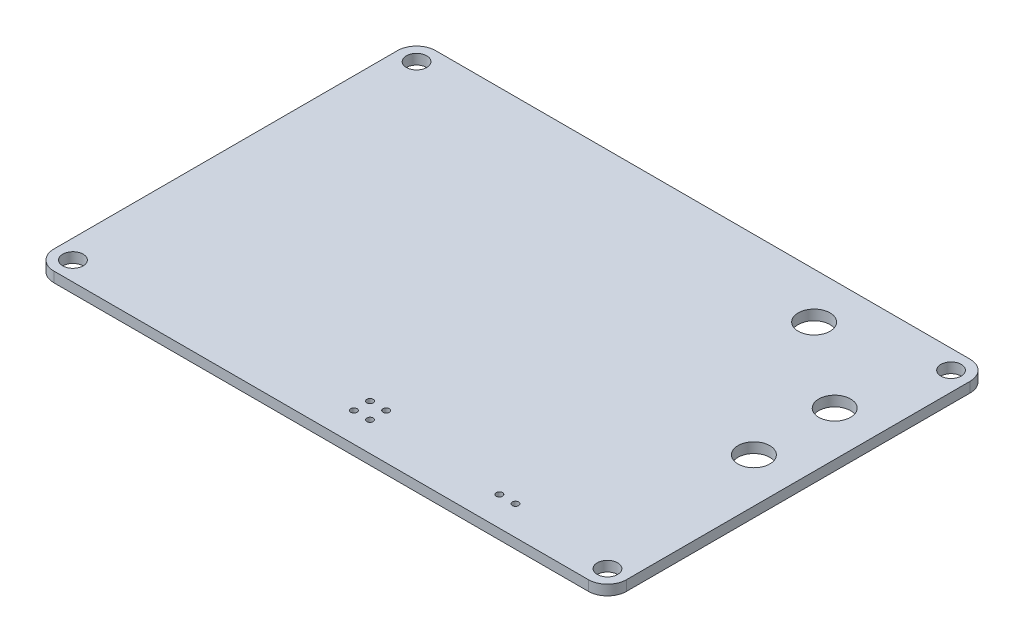
ISO-10303-21;
HEADER;
FILE_DESCRIPTION(('STEP AP214'),'2;1');
FILE_NAME('part.step','',(''),(''),'','','');
FILE_SCHEMA(('AUTOMOTIVE_DESIGN { 1 0 10303 214 1 1 1 1 }'));
ENDSEC;
DATA;
#1=APPLICATION_CONTEXT('core data for automotive mechanical design processes');
#2=APPLICATION_PROTOCOL_DEFINITION('international standard','automotive_design',2000,#1);
#3=PRODUCT_CONTEXT('',#1,'mechanical');
#4=PRODUCT('Part','Part','',(#3));
#5=PRODUCT_RELATED_PRODUCT_CATEGORY('part','',(#4));
#6=PRODUCT_DEFINITION_FORMATION('','',#4);
#7=PRODUCT_DEFINITION_CONTEXT('part definition',#1,'design');
#8=PRODUCT_DEFINITION('design','',#6,#7);
#9=PRODUCT_DEFINITION_SHAPE('','',#8);
#10=(LENGTH_UNIT() NAMED_UNIT(*) SI_UNIT(.MILLI.,.METRE.));
#11=(NAMED_UNIT(*) PLANE_ANGLE_UNIT() SI_UNIT($,.RADIAN.));
#12=(NAMED_UNIT(*) SI_UNIT($,.STERADIAN.) SOLID_ANGLE_UNIT());
#13=UNCERTAINTY_MEASURE_WITH_UNIT(LENGTH_MEASURE(1.E-05),#10,'distance_accuracy_value','');
#14=(GEOMETRIC_REPRESENTATION_CONTEXT(3) GLOBAL_UNCERTAINTY_ASSIGNED_CONTEXT((#13)) GLOBAL_UNIT_ASSIGNED_CONTEXT((#10,
#11,#12)) REPRESENTATION_CONTEXT('',''));
#15=CARTESIAN_POINT('',(0.,0.,0.));
#16=DIRECTION('',(0.,0.,1.));
#17=DIRECTION('',(1.,0.,0.));
#18=AXIS2_PLACEMENT_3D('',#15,#16,#17);
#19=CARTESIAN_POINT('',(-45.,1.6,30.));
#20=DIRECTION('',(1.,0.,0.));
#21=DIRECTION('',(0.,0.,-1.));
#22=AXIS2_PLACEMENT_3D('',#19,#20,#21);
#23=PLANE('',#22);
#24=DIRECTION('',(0.,0.,1.));
#25=VECTOR('',#24,1.);
#26=CARTESIAN_POINT('',(-45.,0.,30.));
#27=LINE('',#26,#25);
#28=CARTESIAN_POINT('',(-45.,0.,-27.));
#29=VERTEX_POINT('',#28);
#30=CARTESIAN_POINT('',(-45.,0.,27.));
#31=VERTEX_POINT('',#30);
#32=EDGE_CURVE('E157',#29,#31,#27,.T.);
#33=ORIENTED_EDGE('',*,*,#32,.T.);
#34=DIRECTION('',(0.,-1.,0.));
#35=VECTOR('',#34,1.);
#36=CARTESIAN_POINT('',(-45.,1.6,27.));
#37=LINE('',#36,#35);
#38=CARTESIAN_POINT('',(-45.,1.6,27.));
#39=VERTEX_POINT('',#38);
#40=EDGE_CURVE('E11',#31,#39,#37,.F.);
#41=ORIENTED_EDGE('',*,*,#40,.T.);
#42=DIRECTION('',(0.,0.,1.));
#43=VECTOR('',#42,1.);
#44=CARTESIAN_POINT('',(-45.,1.6,30.));
#45=LINE('',#44,#43);
#46=CARTESIAN_POINT('',(-45.,1.6,-27.));
#47=VERTEX_POINT('',#46);
#48=EDGE_CURVE('E125',#47,#39,#45,.T.);
#49=ORIENTED_EDGE('',*,*,#48,.F.);
#50=DIRECTION('',(0.,-1.,0.));
#51=VECTOR('',#50,1.);
#52=CARTESIAN_POINT('',(-45.,1.6,-27.));
#53=LINE('',#52,#51);
#54=EDGE_CURVE('E41',#47,#29,#53,.T.);
#55=ORIENTED_EDGE('',*,*,#54,.T.);
#56=EDGE_LOOP('',(#33,#41,#49,#55));
#57=FACE_BOUND('',#56,.T.);
#58=ADVANCED_FACE('F33',(#57),#23,.F.);
#59=CARTESIAN_POINT('',(45.,1.6,30.));
#60=DIRECTION('',(0.,0.,-1.));
#61=DIRECTION('',(-1.,0.,0.));
#62=AXIS2_PLACEMENT_3D('',#59,#60,#61);
#63=PLANE('',#62);
#64=DIRECTION('',(1.,0.,0.));
#65=VECTOR('',#64,1.);
#66=CARTESIAN_POINT('',(45.,0.,30.));
#67=LINE('',#66,#65);
#68=CARTESIAN_POINT('',(-42.,0.,30.));
#69=VERTEX_POINT('',#68);
#70=CARTESIAN_POINT('',(42.,0.,30.));
#71=VERTEX_POINT('',#70);
#72=EDGE_CURVE('E130',#69,#71,#67,.T.);
#73=ORIENTED_EDGE('',*,*,#72,.T.);
#74=DIRECTION('',(0.,-1.,0.));
#75=VECTOR('',#74,1.);
#76=CARTESIAN_POINT('',(42.,1.6,30.));
#77=LINE('',#76,#75);
#78=CARTESIAN_POINT('',(42.,1.6,30.));
#79=VERTEX_POINT('',#78);
#80=EDGE_CURVE('E48',#71,#79,#77,.F.);
#81=ORIENTED_EDGE('',*,*,#80,.T.);
#82=DIRECTION('',(1.,0.,0.));
#83=VECTOR('',#82,1.);
#84=CARTESIAN_POINT('',(45.,1.6,30.));
#85=LINE('',#84,#83);
#86=CARTESIAN_POINT('',(-42.,1.6,30.));
#87=VERTEX_POINT('',#86);
#88=EDGE_CURVE('E128',#87,#79,#85,.T.);
#89=ORIENTED_EDGE('',*,*,#88,.F.);
#90=DIRECTION('',(0.,-1.,0.));
#91=VECTOR('',#90,1.);
#92=CARTESIAN_POINT('',(-42.,1.6,30.));
#93=LINE('',#92,#91);
#94=EDGE_CURVE('E149',#87,#69,#93,.T.);
#95=ORIENTED_EDGE('',*,*,#94,.T.);
#96=EDGE_LOOP('',(#73,#81,#89,#95));
#97=FACE_BOUND('',#96,.T.);
#98=ADVANCED_FACE('F291',(#97),#63,.F.);
#99=CARTESIAN_POINT('',(45.,1.6,30.));
#100=DIRECTION('',(-1.,0.,0.));
#101=DIRECTION('',(0.,0.,1.));
#102=AXIS2_PLACEMENT_3D('',#99,#100,#101);
#103=PLANE('',#102);
#104=DIRECTION('',(0.,0.,-1.));
#105=VECTOR('',#104,1.);
#106=CARTESIAN_POINT('',(45.,0.,30.));
#107=LINE('',#106,#105);
#108=CARTESIAN_POINT('',(45.,0.,27.));
#109=VERTEX_POINT('',#108);
#110=CARTESIAN_POINT('',(45.,0.,-27.));
#111=VERTEX_POINT('',#110);
#112=EDGE_CURVE('E126',#109,#111,#107,.T.);
#113=ORIENTED_EDGE('',*,*,#112,.T.);
#114=DIRECTION('',(0.,-1.,0.));
#115=VECTOR('',#114,1.);
#116=CARTESIAN_POINT('',(45.,1.6,-27.));
#117=LINE('',#116,#115);
#118=CARTESIAN_POINT('',(45.,1.6,-27.));
#119=VERTEX_POINT('',#118);
#120=EDGE_CURVE('E104',#111,#119,#117,.F.);
#121=ORIENTED_EDGE('',*,*,#120,.T.);
#122=DIRECTION('',(0.,0.,-1.));
#123=VECTOR('',#122,1.);
#124=CARTESIAN_POINT('',(45.,1.6,30.));
#125=LINE('',#124,#123);
#126=CARTESIAN_POINT('',(45.,1.6,27.));
#127=VERTEX_POINT('',#126);
#128=EDGE_CURVE('E169',#127,#119,#125,.T.);
#129=ORIENTED_EDGE('',*,*,#128,.F.);
#130=DIRECTION('',(0.,-1.,0.));
#131=VECTOR('',#130,1.);
#132=CARTESIAN_POINT('',(45.,1.6,27.));
#133=LINE('',#132,#131);
#134=EDGE_CURVE('E109',#127,#109,#133,.T.);
#135=ORIENTED_EDGE('',*,*,#134,.T.);
#136=EDGE_LOOP('',(#113,#121,#129,#135));
#137=FACE_BOUND('',#136,.T.);
#138=ADVANCED_FACE('F288',(#137),#103,.F.);
#139=CARTESIAN_POINT('',(45.,1.6,-30.));
#140=DIRECTION('',(0.,0.,1.));
#141=DIRECTION('',(1.,0.,0.));
#142=AXIS2_PLACEMENT_3D('',#139,#140,#141);
#143=PLANE('',#142);
#144=DIRECTION('',(-1.,0.,0.));
#145=VECTOR('',#144,1.);
#146=CARTESIAN_POINT('',(45.,1.6,-30.));
#147=LINE('',#146,#145);
#148=CARTESIAN_POINT('',(42.,1.6,-30.));
#149=VERTEX_POINT('',#148);
#150=CARTESIAN_POINT('',(-42.,1.6,-30.));
#151=VERTEX_POINT('',#150);
#152=EDGE_CURVE('E119',#149,#151,#147,.T.);
#153=ORIENTED_EDGE('',*,*,#152,.F.);
#154=DIRECTION('',(0.,-1.,0.));
#155=VECTOR('',#154,1.);
#156=CARTESIAN_POINT('',(42.,1.6,-30.));
#157=LINE('',#156,#155);
#158=CARTESIAN_POINT('',(42.,0.,-30.));
#159=VERTEX_POINT('',#158);
#160=EDGE_CURVE('E103',#149,#159,#157,.T.);
#161=ORIENTED_EDGE('',*,*,#160,.T.);
#162=DIRECTION('',(-1.,0.,0.));
#163=VECTOR('',#162,1.);
#164=CARTESIAN_POINT('',(45.,0.,-30.));
#165=LINE('',#164,#163);
#166=CARTESIAN_POINT('',(-42.,0.,-30.));
#167=VERTEX_POINT('',#166);
#168=EDGE_CURVE('E116',#159,#167,#165,.T.);
#169=ORIENTED_EDGE('',*,*,#168,.T.);
#170=DIRECTION('',(0.,-1.,0.));
#171=VECTOR('',#170,1.);
#172=CARTESIAN_POINT('',(-42.,1.6,-30.));
#173=LINE('',#172,#171);
#174=EDGE_CURVE('E121',#167,#151,#173,.F.);
#175=ORIENTED_EDGE('',*,*,#174,.T.);
#176=EDGE_LOOP('',(#153,#161,#169,#175));
#177=FACE_BOUND('',#176,.T.);
#178=ADVANCED_FACE('F115',(#177),#143,.F.);
#179=CARTESIAN_POINT('',(-45.,1.6,-30.));
#180=DIRECTION('',(0.,1.,0.));
#181=DIRECTION('',(0.,0.,1.));
#182=AXIS2_PLACEMENT_3D('',#179,#180,#181);
#183=PLANE('',#182);
#184=CARTESIAN_POINT('',(24.68,1.6,-22.8));
#185=DIRECTION('',(0.,1.,0.));
#186=DIRECTION('',(0.,0.,1.));
#187=AXIS2_PLACEMENT_3D('',#184,#185,#186);
#188=CIRCLE('',#187,2.5);
#189=CARTESIAN_POINT('',(24.68,1.6,-20.3));
#190=VERTEX_POINT('',#189);
#191=EDGE_CURVE('E242',#190,#190,#188,.T.);
#192=ORIENTED_EDGE('',*,*,#191,.F.);
#193=EDGE_LOOP('',(#192));
#194=FACE_BOUND('',#193,.T.);
#195=CARTESIAN_POINT('',(38.015,1.6,-12.7));
#196=DIRECTION('',(0.,1.,0.));
#197=DIRECTION('',(0.,0.,1.));
#198=AXIS2_PLACEMENT_3D('',#195,#196,#197);
#199=CIRCLE('',#198,2.5);
#200=CARTESIAN_POINT('',(38.015,1.6,-10.2));
#201=VERTEX_POINT('',#200);
#202=EDGE_CURVE('E236',#201,#201,#199,.T.);
#203=ORIENTED_EDGE('',*,*,#202,.F.);
#204=EDGE_LOOP('',(#203));
#205=FACE_BOUND('',#204,.T.);
#206=CARTESIAN_POINT('',(38.015,1.6,0.));
#207=DIRECTION('',(0.,1.,0.));
#208=DIRECTION('',(0.,0.,1.));
#209=AXIS2_PLACEMENT_3D('',#206,#207,#208);
#210=CIRCLE('',#209,2.5);
#211=CARTESIAN_POINT('',(38.015,1.6,2.49999999999999));
#212=VERTEX_POINT('',#211);
#213=EDGE_CURVE('E230',#212,#212,#210,.T.);
#214=ORIENTED_EDGE('',*,*,#213,.F.);
#215=EDGE_LOOP('',(#214));
#216=FACE_BOUND('',#215,.T.);
#217=CARTESIAN_POINT('',(25.95,1.6,25.4));
#218=DIRECTION('',(0.,1.,0.));
#219=DIRECTION('',(0.,0.,1.));
#220=AXIS2_PLACEMENT_3D('',#217,#218,#219);
#221=CIRCLE('',#220,0.499999999999999);
#222=CARTESIAN_POINT('',(25.95,1.6,25.9));
#223=VERTEX_POINT('',#222);
#224=EDGE_CURVE('E224',#223,#223,#221,.T.);
#225=ORIENTED_EDGE('',*,*,#224,.F.);
#226=EDGE_LOOP('',(#225));
#227=FACE_BOUND('',#226,.T.);
#228=CARTESIAN_POINT('',(23.41,1.6,25.4));
#229=DIRECTION('',(0.,1.,0.));
#230=DIRECTION('',(0.,0.,1.));
#231=AXIS2_PLACEMENT_3D('',#228,#229,#230);
#232=CIRCLE('',#231,0.499999999999999);
#233=CARTESIAN_POINT('',(23.41,1.6,25.9));
#234=VERTEX_POINT('',#233);
#235=EDGE_CURVE('E218',#234,#234,#232,.T.);
#236=ORIENTED_EDGE('',*,*,#235,.F.);
#237=EDGE_LOOP('',(#236));
#238=FACE_BOUND('',#237,.T.);
#239=CARTESIAN_POINT('',(3.09,1.6,22.86));
#240=DIRECTION('',(0.,1.,0.));
#241=DIRECTION('',(0.,0.,1.));
#242=AXIS2_PLACEMENT_3D('',#239,#240,#241);
#243=CIRCLE('',#242,0.5);
#244=CARTESIAN_POINT('',(3.09,1.6,23.36));
#245=VERTEX_POINT('',#244);
#246=EDGE_CURVE('E212',#245,#245,#243,.T.);
#247=ORIENTED_EDGE('',*,*,#246,.F.);
#248=EDGE_LOOP('',(#247));
#249=FACE_BOUND('',#248,.T.);
#250=CARTESIAN_POINT('',(3.09,1.6,25.4));
#251=DIRECTION('',(0.,1.,0.));
#252=DIRECTION('',(0.,0.,1.));
#253=AXIS2_PLACEMENT_3D('',#250,#251,#252);
#254=CIRCLE('',#253,0.5);
#255=CARTESIAN_POINT('',(3.09,1.6,25.9));
#256=VERTEX_POINT('',#255);
#257=EDGE_CURVE('E206',#256,#256,#254,.T.);
#258=ORIENTED_EDGE('',*,*,#257,.F.);
#259=EDGE_LOOP('',(#258));
#260=FACE_BOUND('',#259,.T.);
#261=CARTESIAN_POINT('',(0.549999999999995,1.6,22.86));
#262=DIRECTION('',(0.,1.,0.));
#263=DIRECTION('',(0.,0.,1.));
#264=AXIS2_PLACEMENT_3D('',#261,#262,#263);
#265=CIRCLE('',#264,0.5);
#266=CARTESIAN_POINT('',(0.549999999999995,1.6,23.36));
#267=VERTEX_POINT('',#266);
#268=EDGE_CURVE('E200',#267,#267,#265,.T.);
#269=ORIENTED_EDGE('',*,*,#268,.F.);
#270=EDGE_LOOP('',(#269));
#271=FACE_BOUND('',#270,.T.);
#272=CARTESIAN_POINT('',(0.549999999999995,1.6,25.4));
#273=DIRECTION('',(0.,1.,0.));
#274=DIRECTION('',(0.,0.,1.));
#275=AXIS2_PLACEMENT_3D('',#272,#273,#274);
#276=CIRCLE('',#275,0.5);
#277=CARTESIAN_POINT('',(0.549999999999995,1.6,25.9));
#278=VERTEX_POINT('',#277);
#279=EDGE_CURVE('E194',#278,#278,#276,.T.);
#280=ORIENTED_EDGE('',*,*,#279,.F.);
#281=EDGE_LOOP('',(#280));
#282=FACE_BOUND('',#281,.T.);
#283=CARTESIAN_POINT('',(42.,1.6,-27.));
#284=DIRECTION('',(0.,1.,0.));
#285=DIRECTION('',(0.,0.,1.));
#286=AXIS2_PLACEMENT_3D('',#283,#284,#285);
#287=CIRCLE('',#286,1.6);
#288=CARTESIAN_POINT('',(42.,1.6,-25.4));
#289=VERTEX_POINT('',#288);
#290=EDGE_CURVE('E188',#289,#289,#287,.T.);
#291=ORIENTED_EDGE('',*,*,#290,.F.);
#292=EDGE_LOOP('',(#291));
#293=FACE_BOUND('',#292,.T.);
#294=CARTESIAN_POINT('',(42.,1.6,27.));
#295=DIRECTION('',(0.,1.,0.));
#296=DIRECTION('',(0.,0.,1.));
#297=AXIS2_PLACEMENT_3D('',#294,#295,#296);
#298=CIRCLE('',#297,1.6);
#299=CARTESIAN_POINT('',(42.,1.6,28.6));
#300=VERTEX_POINT('',#299);
#301=EDGE_CURVE('E182',#300,#300,#298,.T.);
#302=ORIENTED_EDGE('',*,*,#301,.F.);
#303=EDGE_LOOP('',(#302));
#304=FACE_BOUND('',#303,.T.);
#305=CARTESIAN_POINT('',(-42.,1.6,27.));
#306=DIRECTION('',(0.,1.,0.));
#307=DIRECTION('',(0.,0.,1.));
#308=AXIS2_PLACEMENT_3D('',#305,#306,#307);
#309=CIRCLE('',#308,1.6);
#310=CARTESIAN_POINT('',(-42.,1.6,28.6));
#311=VERTEX_POINT('',#310);
#312=EDGE_CURVE('E176',#311,#311,#309,.T.);
#313=ORIENTED_EDGE('',*,*,#312,.F.);
#314=EDGE_LOOP('',(#313));
#315=FACE_BOUND('',#314,.T.);
#316=CARTESIAN_POINT('',(-42.,1.6,-27.));
#317=DIRECTION('',(0.,1.,0.));
#318=DIRECTION('',(0.,0.,1.));
#319=AXIS2_PLACEMENT_3D('',#316,#317,#318);
#320=CIRCLE('',#319,1.6);
#321=CARTESIAN_POINT('',(-42.,1.6,-25.4));
#322=VERTEX_POINT('',#321);
#323=EDGE_CURVE('E165',#322,#322,#320,.T.);
#324=ORIENTED_EDGE('',*,*,#323,.F.);
#325=EDGE_LOOP('',(#324));
#326=FACE_BOUND('',#325,.T.);
#327=ORIENTED_EDGE('',*,*,#128,.T.);
#328=CARTESIAN_POINT('',(42.,1.6,-27.));
#329=DIRECTION('',(0.,1.,0.));
#330=DIRECTION('',(0.,0.,1.));
#331=AXIS2_PLACEMENT_3D('',#328,#329,#330);
#332=CIRCLE('',#331,3.);
#333=EDGE_CURVE('E147',#119,#149,#332,.T.);
#334=ORIENTED_EDGE('',*,*,#333,.T.);
#335=ORIENTED_EDGE('',*,*,#152,.T.);
#336=CARTESIAN_POINT('',(-42.,1.6,-27.));
#337=DIRECTION('',(0.,1.,0.));
#338=DIRECTION('',(0.,0.,1.));
#339=AXIS2_PLACEMENT_3D('',#336,#337,#338);
#340=CIRCLE('',#339,3.);
#341=EDGE_CURVE('E142',#151,#47,#340,.T.);
#342=ORIENTED_EDGE('',*,*,#341,.T.);
#343=ORIENTED_EDGE('',*,*,#48,.T.);
#344=CARTESIAN_POINT('',(-42.,1.6,27.));
#345=DIRECTION('',(0.,1.,0.));
#346=DIRECTION('',(0.,0.,1.));
#347=AXIS2_PLACEMENT_3D('',#344,#345,#346);
#348=CIRCLE('',#347,3.);
#349=EDGE_CURVE('E55',#39,#87,#348,.T.);
#350=ORIENTED_EDGE('',*,*,#349,.T.);
#351=ORIENTED_EDGE('',*,*,#88,.T.);
#352=CARTESIAN_POINT('',(42.,1.6,27.));
#353=DIRECTION('',(0.,1.,0.));
#354=DIRECTION('',(0.,0.,1.));
#355=AXIS2_PLACEMENT_3D('',#352,#353,#354);
#356=CIRCLE('',#355,3.);
#357=EDGE_CURVE('E145',#79,#127,#356,.T.);
#358=ORIENTED_EDGE('',*,*,#357,.T.);
#359=EDGE_LOOP('',(#327,#334,#335,#342,#343,#350,#351,#358));
#360=FACE_BOUND('',#359,.T.);
#361=ADVANCED_FACE('F257',(#194,#205,#216,#227,#238,#249,#260,#271,#282,#293,#304,#315,#326,
#360),#183,.T.);
#362=CARTESIAN_POINT('',(-45.,0.,-30.));
#363=DIRECTION('',(0.,1.,0.));
#364=DIRECTION('',(0.,0.,1.));
#365=AXIS2_PLACEMENT_3D('',#362,#363,#364);
#366=PLANE('',#365);
#367=CARTESIAN_POINT('',(24.68,0.,-22.8));
#368=DIRECTION('',(0.,1.,0.));
#369=DIRECTION('',(0.,0.,1.));
#370=AXIS2_PLACEMENT_3D('',#367,#368,#369);
#371=CIRCLE('',#370,2.5);
#372=CARTESIAN_POINT('',(24.68,0.,-20.3));
#373=VERTEX_POINT('',#372);
#374=EDGE_CURVE('E239',#373,#373,#371,.T.);
#375=ORIENTED_EDGE('',*,*,#374,.T.);
#376=EDGE_LOOP('',(#375));
#377=FACE_BOUND('',#376,.T.);
#378=CARTESIAN_POINT('',(38.015,0.,-12.7));
#379=DIRECTION('',(0.,1.,0.));
#380=DIRECTION('',(0.,0.,1.));
#381=AXIS2_PLACEMENT_3D('',#378,#379,#380);
#382=CIRCLE('',#381,2.5);
#383=CARTESIAN_POINT('',(38.015,0.,-10.2));
#384=VERTEX_POINT('',#383);
#385=EDGE_CURVE('E233',#384,#384,#382,.T.);
#386=ORIENTED_EDGE('',*,*,#385,.T.);
#387=EDGE_LOOP('',(#386));
#388=FACE_BOUND('',#387,.T.);
#389=CARTESIAN_POINT('',(38.015,0.,0.));
#390=DIRECTION('',(0.,1.,0.));
#391=DIRECTION('',(0.,0.,1.));
#392=AXIS2_PLACEMENT_3D('',#389,#390,#391);
#393=CIRCLE('',#392,2.5);
#394=CARTESIAN_POINT('',(38.015,0.,2.49999999999999));
#395=VERTEX_POINT('',#394);
#396=EDGE_CURVE('E227',#395,#395,#393,.T.);
#397=ORIENTED_EDGE('',*,*,#396,.T.);
#398=EDGE_LOOP('',(#397));
#399=FACE_BOUND('',#398,.T.);
#400=CARTESIAN_POINT('',(25.95,0.,25.4));
#401=DIRECTION('',(0.,1.,0.));
#402=DIRECTION('',(0.,0.,1.));
#403=AXIS2_PLACEMENT_3D('',#400,#401,#402);
#404=CIRCLE('',#403,0.499999999999999);
#405=CARTESIAN_POINT('',(25.95,0.,25.9));
#406=VERTEX_POINT('',#405);
#407=EDGE_CURVE('E221',#406,#406,#404,.T.);
#408=ORIENTED_EDGE('',*,*,#407,.T.);
#409=EDGE_LOOP('',(#408));
#410=FACE_BOUND('',#409,.T.);
#411=CARTESIAN_POINT('',(23.41,0.,25.4));
#412=DIRECTION('',(0.,1.,0.));
#413=DIRECTION('',(0.,0.,1.));
#414=AXIS2_PLACEMENT_3D('',#411,#412,#413);
#415=CIRCLE('',#414,0.499999999999999);
#416=CARTESIAN_POINT('',(23.41,0.,25.9));
#417=VERTEX_POINT('',#416);
#418=EDGE_CURVE('E215',#417,#417,#415,.T.);
#419=ORIENTED_EDGE('',*,*,#418,.T.);
#420=EDGE_LOOP('',(#419));
#421=FACE_BOUND('',#420,.T.);
#422=CARTESIAN_POINT('',(3.09,0.,22.86));
#423=DIRECTION('',(0.,1.,0.));
#424=DIRECTION('',(0.,0.,1.));
#425=AXIS2_PLACEMENT_3D('',#422,#423,#424);
#426=CIRCLE('',#425,0.5);
#427=CARTESIAN_POINT('',(3.09,0.,23.36));
#428=VERTEX_POINT('',#427);
#429=EDGE_CURVE('E209',#428,#428,#426,.T.);
#430=ORIENTED_EDGE('',*,*,#429,.T.);
#431=EDGE_LOOP('',(#430));
#432=FACE_BOUND('',#431,.T.);
#433=CARTESIAN_POINT('',(3.09,0.,25.4));
#434=DIRECTION('',(0.,1.,0.));
#435=DIRECTION('',(0.,0.,1.));
#436=AXIS2_PLACEMENT_3D('',#433,#434,#435);
#437=CIRCLE('',#436,0.5);
#438=CARTESIAN_POINT('',(3.09,0.,25.9));
#439=VERTEX_POINT('',#438);
#440=EDGE_CURVE('E203',#439,#439,#437,.T.);
#441=ORIENTED_EDGE('',*,*,#440,.T.);
#442=EDGE_LOOP('',(#441));
#443=FACE_BOUND('',#442,.T.);
#444=CARTESIAN_POINT('',(0.549999999999995,0.,22.86));
#445=DIRECTION('',(0.,1.,0.));
#446=DIRECTION('',(0.,0.,1.));
#447=AXIS2_PLACEMENT_3D('',#444,#445,#446);
#448=CIRCLE('',#447,0.5);
#449=CARTESIAN_POINT('',(0.549999999999995,0.,23.36));
#450=VERTEX_POINT('',#449);
#451=EDGE_CURVE('E197',#450,#450,#448,.T.);
#452=ORIENTED_EDGE('',*,*,#451,.T.);
#453=EDGE_LOOP('',(#452));
#454=FACE_BOUND('',#453,.T.);
#455=CARTESIAN_POINT('',(0.549999999999995,0.,25.4));
#456=DIRECTION('',(0.,1.,0.));
#457=DIRECTION('',(0.,0.,1.));
#458=AXIS2_PLACEMENT_3D('',#455,#456,#457);
#459=CIRCLE('',#458,0.5);
#460=CARTESIAN_POINT('',(0.549999999999995,0.,25.9));
#461=VERTEX_POINT('',#460);
#462=EDGE_CURVE('E191',#461,#461,#459,.T.);
#463=ORIENTED_EDGE('',*,*,#462,.T.);
#464=EDGE_LOOP('',(#463));
#465=FACE_BOUND('',#464,.T.);
#466=CARTESIAN_POINT('',(42.,0.,-27.));
#467=DIRECTION('',(0.,1.,0.));
#468=DIRECTION('',(0.,0.,1.));
#469=AXIS2_PLACEMENT_3D('',#466,#467,#468);
#470=CIRCLE('',#469,1.6);
#471=CARTESIAN_POINT('',(42.,0.,-25.4));
#472=VERTEX_POINT('',#471);
#473=EDGE_CURVE('E185',#472,#472,#470,.T.);
#474=ORIENTED_EDGE('',*,*,#473,.T.);
#475=EDGE_LOOP('',(#474));
#476=FACE_BOUND('',#475,.T.);
#477=CARTESIAN_POINT('',(42.,0.,27.));
#478=DIRECTION('',(0.,1.,0.));
#479=DIRECTION('',(0.,0.,1.));
#480=AXIS2_PLACEMENT_3D('',#477,#478,#479);
#481=CIRCLE('',#480,1.6);
#482=CARTESIAN_POINT('',(42.,0.,28.6));
#483=VERTEX_POINT('',#482);
#484=EDGE_CURVE('E179',#483,#483,#481,.T.);
#485=ORIENTED_EDGE('',*,*,#484,.T.);
#486=EDGE_LOOP('',(#485));
#487=FACE_BOUND('',#486,.T.);
#488=CARTESIAN_POINT('',(-42.,0.,27.));
#489=DIRECTION('',(0.,1.,0.));
#490=DIRECTION('',(0.,0.,1.));
#491=AXIS2_PLACEMENT_3D('',#488,#489,#490);
#492=CIRCLE('',#491,1.6);
#493=CARTESIAN_POINT('',(-42.,0.,28.6));
#494=VERTEX_POINT('',#493);
#495=EDGE_CURVE('E174',#494,#494,#492,.T.);
#496=ORIENTED_EDGE('',*,*,#495,.T.);
#497=EDGE_LOOP('',(#496));
#498=FACE_BOUND('',#497,.T.);
#499=CARTESIAN_POINT('',(-42.,0.,-27.));
#500=DIRECTION('',(0.,1.,0.));
#501=DIRECTION('',(0.,0.,1.));
#502=AXIS2_PLACEMENT_3D('',#499,#500,#501);
#503=CIRCLE('',#502,1.6);
#504=CARTESIAN_POINT('',(-42.,0.,-25.4));
#505=VERTEX_POINT('',#504);
#506=EDGE_CURVE('E162',#505,#505,#503,.T.);
#507=ORIENTED_EDGE('',*,*,#506,.T.);
#508=EDGE_LOOP('',(#507));
#509=FACE_BOUND('',#508,.T.);
#510=ORIENTED_EDGE('',*,*,#168,.F.);
#511=CARTESIAN_POINT('',(42.,0.,-27.));
#512=DIRECTION('',(0.,1.,0.));
#513=DIRECTION('',(0.,0.,1.));
#514=AXIS2_PLACEMENT_3D('',#511,#512,#513);
#515=CIRCLE('',#514,3.);
#516=EDGE_CURVE('E99',#159,#111,#515,.F.);
#517=ORIENTED_EDGE('',*,*,#516,.T.);
#518=ORIENTED_EDGE('',*,*,#112,.F.);
#519=CARTESIAN_POINT('',(42.,0.,27.));
#520=DIRECTION('',(0.,1.,0.));
#521=DIRECTION('',(0.,0.,1.));
#522=AXIS2_PLACEMENT_3D('',#519,#520,#521);
#523=CIRCLE('',#522,3.);
#524=EDGE_CURVE('E110',#109,#71,#523,.F.);
#525=ORIENTED_EDGE('',*,*,#524,.T.);
#526=ORIENTED_EDGE('',*,*,#72,.F.);
#527=CARTESIAN_POINT('',(-42.,0.,27.));
#528=DIRECTION('',(0.,1.,0.));
#529=DIRECTION('',(0.,0.,1.));
#530=AXIS2_PLACEMENT_3D('',#527,#528,#529);
#531=CIRCLE('',#530,3.);
#532=EDGE_CURVE('E136',#69,#31,#531,.F.);
#533=ORIENTED_EDGE('',*,*,#532,.T.);
#534=ORIENTED_EDGE('',*,*,#32,.F.);
#535=CARTESIAN_POINT('',(-42.,0.,-27.));
#536=DIRECTION('',(0.,1.,0.));
#537=DIRECTION('',(0.,0.,1.));
#538=AXIS2_PLACEMENT_3D('',#535,#536,#537);
#539=CIRCLE('',#538,3.);
#540=EDGE_CURVE('E120',#29,#167,#539,.F.);
#541=ORIENTED_EDGE('',*,*,#540,.T.);
#542=EDGE_LOOP('',(#510,#517,#518,#525,#526,#533,#534,#541));
#543=FACE_BOUND('',#542,.T.);
#544=ADVANCED_FACE('F123',(#377,#388,#399,#410,#421,#432,#443,#454,#465,#476,#487,#498,#509,
#543),#366,.F.);
#545=CARTESIAN_POINT('',(-42.,0.,-27.));
#546=DIRECTION('',(0.,1.,0.));
#547=DIRECTION('',(0.,0.,1.));
#548=AXIS2_PLACEMENT_3D('',#545,#546,#547);
#549=CYLINDRICAL_SURFACE('',#548,1.6);
#550=ORIENTED_EDGE('',*,*,#506,.F.);
#551=EDGE_LOOP('',(#550));
#552=FACE_BOUND('',#551,.T.);
#553=ORIENTED_EDGE('',*,*,#323,.T.);
#554=EDGE_LOOP('',(#553));
#555=FACE_BOUND('',#554,.T.);
#556=ADVANCED_FACE('F347',(#552,#555),#549,.F.);
#557=CARTESIAN_POINT('',(-42.,0.,27.));
#558=DIRECTION('',(0.,1.,0.));
#559=DIRECTION('',(0.,0.,1.));
#560=AXIS2_PLACEMENT_3D('',#557,#558,#559);
#561=CYLINDRICAL_SURFACE('',#560,1.6);
#562=ORIENTED_EDGE('',*,*,#495,.F.);
#563=EDGE_LOOP('',(#562));
#564=FACE_BOUND('',#563,.T.);
#565=ORIENTED_EDGE('',*,*,#312,.T.);
#566=EDGE_LOOP('',(#565));
#567=FACE_BOUND('',#566,.T.);
#568=ADVANCED_FACE('F440',(#564,#567),#561,.F.);
#569=CARTESIAN_POINT('',(42.,0.,27.));
#570=DIRECTION('',(0.,1.,0.));
#571=DIRECTION('',(0.,0.,1.));
#572=AXIS2_PLACEMENT_3D('',#569,#570,#571);
#573=CYLINDRICAL_SURFACE('',#572,1.6);
#574=ORIENTED_EDGE('',*,*,#484,.F.);
#575=EDGE_LOOP('',(#574));
#576=FACE_BOUND('',#575,.T.);
#577=ORIENTED_EDGE('',*,*,#301,.T.);
#578=EDGE_LOOP('',(#577));
#579=FACE_BOUND('',#578,.T.);
#580=ADVANCED_FACE('F436',(#576,#579),#573,.F.);
#581=CARTESIAN_POINT('',(42.,0.,-27.));
#582=DIRECTION('',(0.,1.,0.));
#583=DIRECTION('',(0.,0.,1.));
#584=AXIS2_PLACEMENT_3D('',#581,#582,#583);
#585=CYLINDRICAL_SURFACE('',#584,1.6);
#586=ORIENTED_EDGE('',*,*,#473,.F.);
#587=EDGE_LOOP('',(#586));
#588=FACE_BOUND('',#587,.T.);
#589=ORIENTED_EDGE('',*,*,#290,.T.);
#590=EDGE_LOOP('',(#589));
#591=FACE_BOUND('',#590,.T.);
#592=ADVANCED_FACE('F314',(#588,#591),#585,.F.);
#593=CARTESIAN_POINT('',(42.,1.6,-27.));
#594=DIRECTION('',(0.,-1.,0.));
#595=DIRECTION('',(0.,0.,-1.));
#596=AXIS2_PLACEMENT_3D('',#593,#594,#595);
#597=CYLINDRICAL_SURFACE('',#596,3.);
#598=ORIENTED_EDGE('',*,*,#333,.F.);
#599=ORIENTED_EDGE('',*,*,#120,.F.);
#600=ORIENTED_EDGE('',*,*,#516,.F.);
#601=ORIENTED_EDGE('',*,*,#160,.F.);
#602=EDGE_LOOP('',(#598,#599,#600,#601));
#603=FACE_BOUND('',#602,.T.);
#604=ADVANCED_FACE('F102',(#603),#597,.T.);
#605=CARTESIAN_POINT('',(42.,1.6,27.));
#606=DIRECTION('',(0.,-1.,0.));
#607=DIRECTION('',(0.,0.,-1.));
#608=AXIS2_PLACEMENT_3D('',#605,#606,#607);
#609=CYLINDRICAL_SURFACE('',#608,3.);
#610=ORIENTED_EDGE('',*,*,#357,.F.);
#611=ORIENTED_EDGE('',*,*,#80,.F.);
#612=ORIENTED_EDGE('',*,*,#524,.F.);
#613=ORIENTED_EDGE('',*,*,#134,.F.);
#614=EDGE_LOOP('',(#610,#611,#612,#613));
#615=FACE_BOUND('',#614,.T.);
#616=ADVANCED_FACE('F290',(#615),#609,.T.);
#617=CARTESIAN_POINT('',(-42.,1.6,27.));
#618=DIRECTION('',(0.,-1.,0.));
#619=DIRECTION('',(0.,0.,-1.));
#620=AXIS2_PLACEMENT_3D('',#617,#618,#619);
#621=CYLINDRICAL_SURFACE('',#620,3.);
#622=ORIENTED_EDGE('',*,*,#349,.F.);
#623=ORIENTED_EDGE('',*,*,#40,.F.);
#624=ORIENTED_EDGE('',*,*,#532,.F.);
#625=ORIENTED_EDGE('',*,*,#94,.F.);
#626=EDGE_LOOP('',(#622,#623,#624,#625));
#627=FACE_BOUND('',#626,.T.);
#628=ADVANCED_FACE('F294',(#627),#621,.T.);
#629=CARTESIAN_POINT('',(-42.,1.6,-27.));
#630=DIRECTION('',(0.,-1.,0.));
#631=DIRECTION('',(0.,0.,-1.));
#632=AXIS2_PLACEMENT_3D('',#629,#630,#631);
#633=CYLINDRICAL_SURFACE('',#632,3.);
#634=ORIENTED_EDGE('',*,*,#341,.F.);
#635=ORIENTED_EDGE('',*,*,#174,.F.);
#636=ORIENTED_EDGE('',*,*,#540,.F.);
#637=ORIENTED_EDGE('',*,*,#54,.F.);
#638=EDGE_LOOP('',(#634,#635,#636,#637));
#639=FACE_BOUND('',#638,.T.);
#640=ADVANCED_FACE('F35',(#639),#633,.T.);
#641=CARTESIAN_POINT('',(0.549999999999995,0.,25.4));
#642=DIRECTION('',(0.,1.,0.));
#643=DIRECTION('',(0.,0.,1.));
#644=AXIS2_PLACEMENT_3D('',#641,#642,#643);
#645=CYLINDRICAL_SURFACE('',#644,0.5);
#646=ORIENTED_EDGE('',*,*,#462,.F.);
#647=EDGE_LOOP('',(#646));
#648=FACE_BOUND('',#647,.T.);
#649=ORIENTED_EDGE('',*,*,#279,.T.);
#650=EDGE_LOOP('',(#649));
#651=FACE_BOUND('',#650,.T.);
#652=ADVANCED_FACE('F296',(#648,#651),#645,.F.);
#653=CARTESIAN_POINT('',(0.549999999999995,0.,22.86));
#654=DIRECTION('',(0.,1.,0.));
#655=DIRECTION('',(0.,0.,1.));
#656=AXIS2_PLACEMENT_3D('',#653,#654,#655);
#657=CYLINDRICAL_SURFACE('',#656,0.5);
#658=ORIENTED_EDGE('',*,*,#451,.F.);
#659=EDGE_LOOP('',(#658));
#660=FACE_BOUND('',#659,.T.);
#661=ORIENTED_EDGE('',*,*,#268,.T.);
#662=EDGE_LOOP('',(#661));
#663=FACE_BOUND('',#662,.T.);
#664=ADVANCED_FACE('F301',(#660,#663),#657,.F.);
#665=CARTESIAN_POINT('',(3.09,0.,25.4));
#666=DIRECTION('',(0.,1.,0.));
#667=DIRECTION('',(0.,0.,1.));
#668=AXIS2_PLACEMENT_3D('',#665,#666,#667);
#669=CYLINDRICAL_SURFACE('',#668,0.5);
#670=ORIENTED_EDGE('',*,*,#440,.F.);
#671=EDGE_LOOP('',(#670));
#672=FACE_BOUND('',#671,.T.);
#673=ORIENTED_EDGE('',*,*,#257,.T.);
#674=EDGE_LOOP('',(#673));
#675=FACE_BOUND('',#674,.T.);
#676=ADVANCED_FACE('F363',(#672,#675),#669,.F.);
#677=CARTESIAN_POINT('',(3.09,0.,22.86));
#678=DIRECTION('',(0.,1.,0.));
#679=DIRECTION('',(0.,0.,1.));
#680=AXIS2_PLACEMENT_3D('',#677,#678,#679);
#681=CYLINDRICAL_SURFACE('',#680,0.5);
#682=ORIENTED_EDGE('',*,*,#429,.F.);
#683=EDGE_LOOP('',(#682));
#684=FACE_BOUND('',#683,.T.);
#685=ORIENTED_EDGE('',*,*,#246,.T.);
#686=EDGE_LOOP('',(#685));
#687=FACE_BOUND('',#686,.T.);
#688=ADVANCED_FACE('F373',(#684,#687),#681,.F.);
#689=CARTESIAN_POINT('',(23.41,0.,25.4));
#690=DIRECTION('',(0.,1.,0.));
#691=DIRECTION('',(0.,0.,1.));
#692=AXIS2_PLACEMENT_3D('',#689,#690,#691);
#693=CYLINDRICAL_SURFACE('',#692,0.499999999999999);
#694=ORIENTED_EDGE('',*,*,#418,.F.);
#695=EDGE_LOOP('',(#694));
#696=FACE_BOUND('',#695,.T.);
#697=ORIENTED_EDGE('',*,*,#235,.T.);
#698=EDGE_LOOP('',(#697));
#699=FACE_BOUND('',#698,.T.);
#700=ADVANCED_FACE('F383',(#696,#699),#693,.F.);
#701=CARTESIAN_POINT('',(25.95,0.,25.4));
#702=DIRECTION('',(0.,1.,0.));
#703=DIRECTION('',(0.,0.,1.));
#704=AXIS2_PLACEMENT_3D('',#701,#702,#703);
#705=CYLINDRICAL_SURFACE('',#704,0.499999999999999);
#706=ORIENTED_EDGE('',*,*,#407,.F.);
#707=EDGE_LOOP('',(#706));
#708=FACE_BOUND('',#707,.T.);
#709=ORIENTED_EDGE('',*,*,#224,.T.);
#710=EDGE_LOOP('',(#709));
#711=FACE_BOUND('',#710,.T.);
#712=ADVANCED_FACE('F393',(#708,#711),#705,.F.);
#713=CARTESIAN_POINT('',(38.015,0.,0.));
#714=DIRECTION('',(0.,1.,0.));
#715=DIRECTION('',(0.,0.,1.));
#716=AXIS2_PLACEMENT_3D('',#713,#714,#715);
#717=CYLINDRICAL_SURFACE('',#716,2.5);
#718=ORIENTED_EDGE('',*,*,#396,.F.);
#719=EDGE_LOOP('',(#718));
#720=FACE_BOUND('',#719,.T.);
#721=ORIENTED_EDGE('',*,*,#213,.T.);
#722=EDGE_LOOP('',(#721));
#723=FACE_BOUND('',#722,.T.);
#724=ADVANCED_FACE('F403',(#720,#723),#717,.F.);
#725=CARTESIAN_POINT('',(38.015,0.,-12.7));
#726=DIRECTION('',(0.,1.,0.));
#727=DIRECTION('',(0.,0.,1.));
#728=AXIS2_PLACEMENT_3D('',#725,#726,#727);
#729=CYLINDRICAL_SURFACE('',#728,2.5);
#730=ORIENTED_EDGE('',*,*,#385,.F.);
#731=EDGE_LOOP('',(#730));
#732=FACE_BOUND('',#731,.T.);
#733=ORIENTED_EDGE('',*,*,#202,.T.);
#734=EDGE_LOOP('',(#733));
#735=FACE_BOUND('',#734,.T.);
#736=ADVANCED_FACE('F253',(#732,#735),#729,.F.);
#737=CARTESIAN_POINT('',(24.68,0.,-22.8));
#738=DIRECTION('',(0.,1.,0.));
#739=DIRECTION('',(0.,0.,1.));
#740=AXIS2_PLACEMENT_3D('',#737,#738,#739);
#741=CYLINDRICAL_SURFACE('',#740,2.5);
#742=ORIENTED_EDGE('',*,*,#374,.F.);
#743=EDGE_LOOP('',(#742));
#744=FACE_BOUND('',#743,.T.);
#745=ORIENTED_EDGE('',*,*,#191,.T.);
#746=EDGE_LOOP('',(#745));
#747=FACE_BOUND('',#746,.T.);
#748=ADVANCED_FACE('F250',(#744,#747),#741,.F.);
#749=CLOSED_SHELL('',(#58,#98,#138,#178,#361,#544,#556,#568,#580,#592,#604,#616,#628,#640,#652,
#664,#676,#688,#700,#712,#724,#736,#748));
#750=MANIFOLD_SOLID_BREP('B2',#749);
#751=ADVANCED_BREP_SHAPE_REPRESENTATION('',(#18,#750),#14);
#752=SHAPE_DEFINITION_REPRESENTATION(#9,#751);
ENDSEC;
END-ISO-10303-21;
